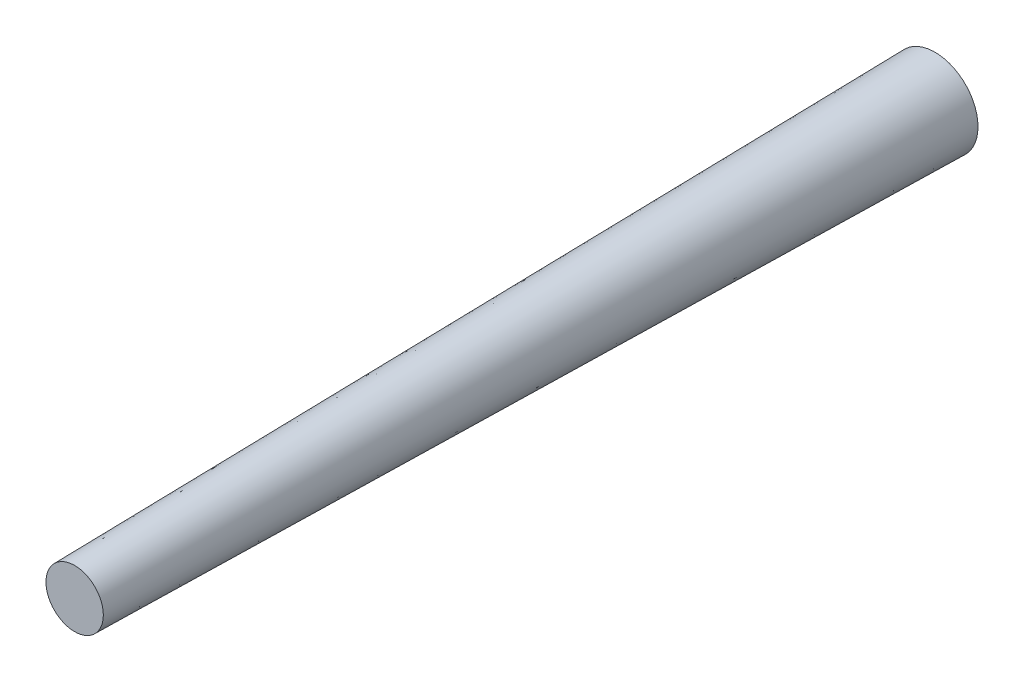
ISO-10303-21;
HEADER;
FILE_DESCRIPTION(('STEP AP214'),'2;1');
FILE_NAME('part.step','',(''),(''),'','','');
FILE_SCHEMA(('AUTOMOTIVE_DESIGN { 1 0 10303 214 1 1 1 1 }'));
ENDSEC;
DATA;
#1=APPLICATION_CONTEXT('core data for automotive mechanical design processes');
#2=APPLICATION_PROTOCOL_DEFINITION('international standard','automotive_design',2000,#1);
#3=PRODUCT_CONTEXT('',#1,'mechanical');
#4=PRODUCT('Part','Part','',(#3));
#5=PRODUCT_RELATED_PRODUCT_CATEGORY('part','',(#4));
#6=PRODUCT_DEFINITION_FORMATION('','',#4);
#7=PRODUCT_DEFINITION_CONTEXT('part definition',#1,'design');
#8=PRODUCT_DEFINITION('design','',#6,#7);
#9=PRODUCT_DEFINITION_SHAPE('','',#8);
#10=(LENGTH_UNIT() NAMED_UNIT(*) SI_UNIT(.MILLI.,.METRE.));
#11=(NAMED_UNIT(*) PLANE_ANGLE_UNIT() SI_UNIT($,.RADIAN.));
#12=(NAMED_UNIT(*) SI_UNIT($,.STERADIAN.) SOLID_ANGLE_UNIT());
#13=UNCERTAINTY_MEASURE_WITH_UNIT(LENGTH_MEASURE(1.E-05),#10,'distance_accuracy_value','');
#14=(GEOMETRIC_REPRESENTATION_CONTEXT(3) GLOBAL_UNCERTAINTY_ASSIGNED_CONTEXT((#13)) GLOBAL_UNIT_ASSIGNED_CONTEXT((#10,
#11,#12)) REPRESENTATION_CONTEXT('',''));
#15=CARTESIAN_POINT('',(0.,0.,0.));
#16=DIRECTION('',(0.,0.,1.));
#17=DIRECTION('',(1.,0.,0.));
#18=AXIS2_PLACEMENT_3D('',#15,#16,#17);
#19=CARTESIAN_POINT('',(0.,0.,0.));
#20=DIRECTION('',(0.,0.,-1.));
#21=DIRECTION('',(1.,0.,0.));
#22=AXIS2_PLACEMENT_3D('',#19,#20,#21);
#23=CONICAL_SURFACE('',#22,3.,0.0166504410640259);
#24=CARTESIAN_POINT('',(0.,0.,60.));
#25=DIRECTION('',(0.,0.,1.));
#26=DIRECTION('',(1.,0.,0.));
#27=AXIS2_PLACEMENT_3D('',#24,#25,#26);
#28=CIRCLE('',#27,2.00088120349014);
#29=CARTESIAN_POINT('',(2.00088120349014,0.,60.));
#30=VERTEX_POINT('',#29);
#31=EDGE_CURVE('E10',#30,#30,#28,.T.);
#32=ORIENTED_EDGE('',*,*,#31,.F.);
#33=EDGE_LOOP('',(#32));
#34=FACE_BOUND('',#33,.T.);
#35=CARTESIAN_POINT('',(0.,0.,0.));
#36=DIRECTION('',(0.,0.,1.));
#37=DIRECTION('',(1.,0.,0.));
#38=AXIS2_PLACEMENT_3D('',#35,#36,#37);
#39=CIRCLE('',#38,3.);
#40=CARTESIAN_POINT('',(3.,0.,0.));
#41=VERTEX_POINT('',#40);
#42=EDGE_CURVE('E48',#41,#41,#39,.T.);
#43=ORIENTED_EDGE('',*,*,#42,.T.);
#44=EDGE_LOOP('',(#43));
#45=FACE_BOUND('',#44,.T.);
#46=ADVANCED_FACE('F41',(#34,#45),#23,.T.);
#47=CARTESIAN_POINT('',(0.,0.,60.));
#48=DIRECTION('',(0.,0.,1.));
#49=DIRECTION('',(1.,0.,0.));
#50=AXIS2_PLACEMENT_3D('',#47,#48,#49);
#51=PLANE('',#50);
#52=ORIENTED_EDGE('',*,*,#31,.T.);
#53=EDGE_LOOP('',(#52));
#54=FACE_BOUND('',#53,.T.);
#55=ADVANCED_FACE('F58',(#54),#51,.T.);
#56=CARTESIAN_POINT('',(0.,0.,0.));
#57=DIRECTION('',(0.,0.,1.));
#58=DIRECTION('',(1.,0.,0.));
#59=AXIS2_PLACEMENT_3D('',#56,#57,#58);
#60=PLANE('',#59);
#61=ORIENTED_EDGE('',*,*,#42,.F.);
#62=EDGE_LOOP('',(#61));
#63=FACE_BOUND('',#62,.T.);
#64=ADVANCED_FACE('F56',(#63),#60,.F.);
#65=CLOSED_SHELL('',(#46,#55,#64));
#66=MANIFOLD_SOLID_BREP('B2',#65);
#67=ADVANCED_BREP_SHAPE_REPRESENTATION('',(#18,#66),#14);
#68=SHAPE_DEFINITION_REPRESENTATION(#9,#67);
ENDSEC;
END-ISO-10303-21;
